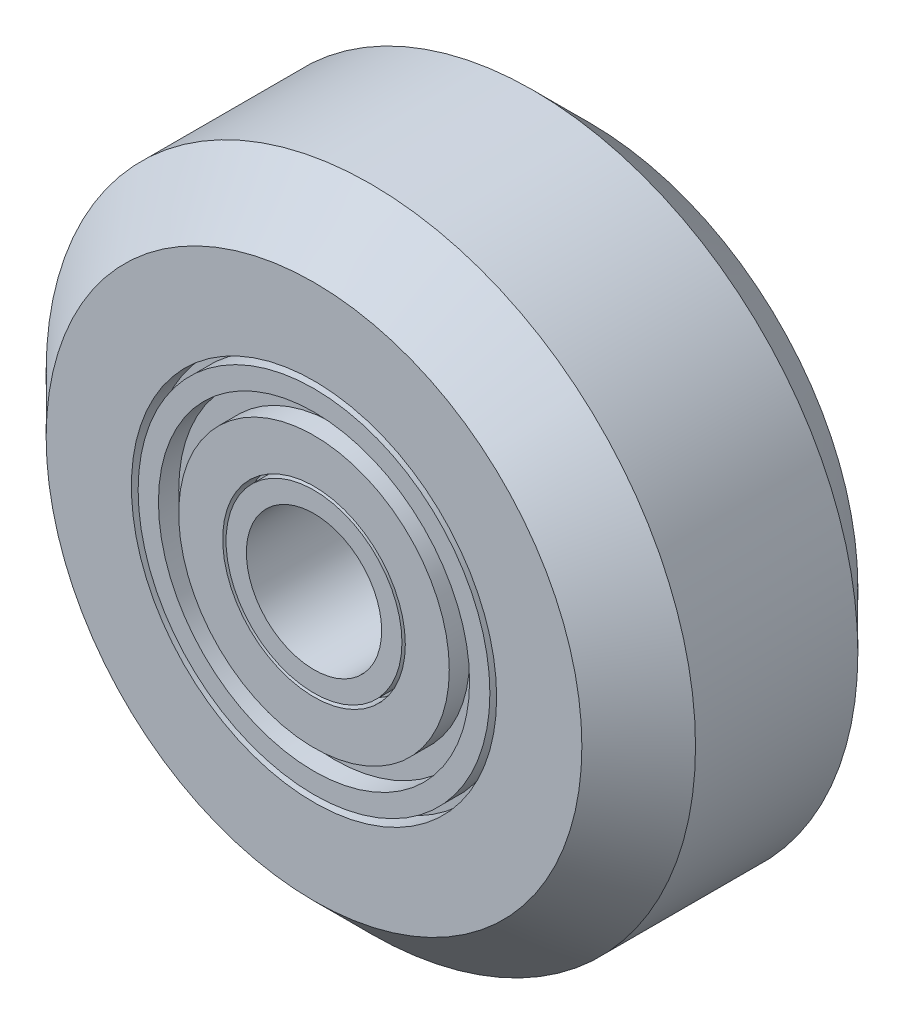
ISO-10303-21;
HEADER;
FILE_DESCRIPTION(('STEP AP214'),'2;1');
FILE_NAME('part.step','',(''),(''),'','','');
FILE_SCHEMA(('AUTOMOTIVE_DESIGN { 1 0 10303 214 1 1 1 1 }'));
ENDSEC;
DATA;
#1=APPLICATION_CONTEXT('core data for automotive mechanical design processes');
#2=APPLICATION_PROTOCOL_DEFINITION('international standard','automotive_design',2000,#1);
#3=PRODUCT_CONTEXT('',#1,'mechanical');
#4=PRODUCT('Part','Part','',(#3));
#5=PRODUCT_RELATED_PRODUCT_CATEGORY('part','',(#4));
#6=PRODUCT_DEFINITION_FORMATION('','',#4);
#7=PRODUCT_DEFINITION_CONTEXT('part definition',#1,'design');
#8=PRODUCT_DEFINITION('design','',#6,#7);
#9=PRODUCT_DEFINITION_SHAPE('','',#8);
#10=(LENGTH_UNIT() NAMED_UNIT(*) SI_UNIT(.MILLI.,.METRE.));
#11=(NAMED_UNIT(*) PLANE_ANGLE_UNIT() SI_UNIT($,.RADIAN.));
#12=(NAMED_UNIT(*) SI_UNIT($,.STERADIAN.) SOLID_ANGLE_UNIT());
#13=UNCERTAINTY_MEASURE_WITH_UNIT(LENGTH_MEASURE(1.E-05),#10,'distance_accuracy_value','');
#14=(GEOMETRIC_REPRESENTATION_CONTEXT(3) GLOBAL_UNCERTAINTY_ASSIGNED_CONTEXT((#13)) GLOBAL_UNIT_ASSIGNED_CONTEXT((#10,
#11,#12)) REPRESENTATION_CONTEXT('',''));
#15=CARTESIAN_POINT('',(0.,0.,0.));
#16=DIRECTION('',(0.,0.,1.));
#17=DIRECTION('',(1.,0.,0.));
#18=AXIS2_PLACEMENT_3D('',#15,#16,#17);
#19=CARTESIAN_POINT('',(0.,0.,-5.1));
#20=DIRECTION('',(0.,0.,-1.));
#21=DIRECTION('',(-1.,0.,0.));
#22=AXIS2_PLACEMENT_3D('',#19,#20,#21);
#23=PLANE('',#22);
#24=CARTESIAN_POINT('',(0.,0.,-5.1));
#25=DIRECTION('',(0.,0.,1.));
#26=DIRECTION('',(1.,0.,0.));
#27=AXIS2_PLACEMENT_3D('',#24,#25,#26);
#28=CIRCLE('',#27,2.5);
#29=CARTESIAN_POINT('',(2.5,0.,-5.1));
#30=VERTEX_POINT('',#29);
#31=EDGE_CURVE('E99',#30,#30,#28,.T.);
#32=ORIENTED_EDGE('',*,*,#31,.T.);
#33=EDGE_LOOP('',(#32));
#34=FACE_BOUND('',#33,.T.);
#35=CARTESIAN_POINT('',(0.,0.,-5.1));
#36=DIRECTION('',(0.,0.,1.));
#37=DIRECTION('',(1.,0.,0.));
#38=AXIS2_PLACEMENT_3D('',#35,#36,#37);
#39=CIRCLE('',#38,3.25);
#40=CARTESIAN_POINT('',(3.25,0.,-5.1));
#41=VERTEX_POINT('',#40);
#42=EDGE_CURVE('E161',#41,#41,#39,.T.);
#43=ORIENTED_EDGE('',*,*,#42,.F.);
#44=EDGE_LOOP('',(#43));
#45=FACE_BOUND('',#44,.T.);
#46=ADVANCED_FACE('F75',(#34,#45),#23,.T.);
#47=CARTESIAN_POINT('',(0.,0.,5.1));
#48=DIRECTION('',(0.,0.,1.));
#49=DIRECTION('',(1.,0.,0.));
#50=AXIS2_PLACEMENT_3D('',#47,#48,#49);
#51=PLANE('',#50);
#52=CARTESIAN_POINT('',(0.,0.,5.1));
#53=DIRECTION('',(0.,0.,1.));
#54=DIRECTION('',(1.,0.,0.));
#55=AXIS2_PLACEMENT_3D('',#52,#53,#54);
#56=CIRCLE('',#55,2.5);
#57=CARTESIAN_POINT('',(2.5,0.,5.1));
#58=VERTEX_POINT('',#57);
#59=EDGE_CURVE('E100',#58,#58,#56,.T.);
#60=ORIENTED_EDGE('',*,*,#59,.F.);
#61=EDGE_LOOP('',(#60));
#62=FACE_BOUND('',#61,.T.);
#63=CARTESIAN_POINT('',(0.,0.,5.1));
#64=DIRECTION('',(0.,0.,1.));
#65=DIRECTION('',(1.,0.,0.));
#66=AXIS2_PLACEMENT_3D('',#63,#64,#65);
#67=CIRCLE('',#66,3.25);
#68=CARTESIAN_POINT('',(3.25,0.,5.1));
#69=VERTEX_POINT('',#68);
#70=EDGE_CURVE('E113',#69,#69,#67,.T.);
#71=ORIENTED_EDGE('',*,*,#70,.T.);
#72=EDGE_LOOP('',(#71));
#73=FACE_BOUND('',#72,.T.);
#74=ADVANCED_FACE('F233',(#62,#73),#51,.T.);
#75=CARTESIAN_POINT('',(0.,0.,3.));
#76=DIRECTION('',(0.,0.,-1.));
#77=DIRECTION('',(-1.,0.,0.));
#78=AXIS2_PLACEMENT_3D('',#75,#76,#77);
#79=CYLINDRICAL_SURFACE('',#78,12.);
#80=CARTESIAN_POINT('',(0.,0.,3.));
#81=DIRECTION('',(0.,0.,1.));
#82=DIRECTION('',(1.,0.,0.));
#83=AXIS2_PLACEMENT_3D('',#80,#81,#82);
#84=CIRCLE('',#83,12.);
#85=CARTESIAN_POINT('',(12.,0.,3.));
#86=VERTEX_POINT('',#85);
#87=EDGE_CURVE('E11',#86,#86,#84,.T.);
#88=ORIENTED_EDGE('',*,*,#87,.F.);
#89=EDGE_LOOP('',(#88));
#90=FACE_BOUND('',#89,.T.);
#91=CARTESIAN_POINT('',(0.,0.,-3.));
#92=DIRECTION('',(0.,0.,-1.));
#93=DIRECTION('',(-1.,0.,0.));
#94=AXIS2_PLACEMENT_3D('',#91,#92,#93);
#95=CIRCLE('',#94,12.);
#96=CARTESIAN_POINT('',(-12.,0.,-3.));
#97=VERTEX_POINT('',#96);
#98=EDGE_CURVE('E93',#97,#97,#95,.T.);
#99=ORIENTED_EDGE('',*,*,#98,.F.);
#100=EDGE_LOOP('',(#99));
#101=FACE_BOUND('',#100,.T.);
#102=ADVANCED_FACE('F77',(#90,#101),#79,.T.);
#103=CARTESIAN_POINT('',(0.,0.,3.));
#104=DIRECTION('',(0.,0.,-1.));
#105=DIRECTION('',(1.,0.,0.));
#106=AXIS2_PLACEMENT_3D('',#103,#104,#105);
#107=CONICAL_SURFACE('',#106,12.,0.78539816339745);
#108=CARTESIAN_POINT('',(0.,0.,5.1));
#109=DIRECTION('',(0.,0.,1.));
#110=DIRECTION('',(1.,0.,0.));
#111=AXIS2_PLACEMENT_3D('',#108,#109,#110);
#112=CIRCLE('',#111,9.89999999999999);
#113=CARTESIAN_POINT('',(9.89999999999999,0.,5.1));
#114=VERTEX_POINT('',#113);
#115=EDGE_CURVE('E83',#114,#114,#112,.T.);
#116=ORIENTED_EDGE('',*,*,#115,.F.);
#117=EDGE_LOOP('',(#116));
#118=FACE_BOUND('',#117,.T.);
#119=ORIENTED_EDGE('',*,*,#87,.T.);
#120=EDGE_LOOP('',(#119));
#121=FACE_BOUND('',#120,.T.);
#122=ADVANCED_FACE('F263',(#118,#121),#107,.T.);
#123=CARTESIAN_POINT('',(0.,0.,5.1));
#124=DIRECTION('',(0.,0.,1.));
#125=DIRECTION('',(1.,0.,0.));
#126=AXIS2_PLACEMENT_3D('',#123,#124,#125);
#127=CIRCLE('',#126,6.75);
#128=CARTESIAN_POINT('',(6.75,0.,5.1));
#129=VERTEX_POINT('',#128);
#130=EDGE_CURVE('E140',#129,#129,#127,.T.);
#131=ORIENTED_EDGE('',*,*,#130,.F.);
#132=EDGE_LOOP('',(#131));
#133=FACE_BOUND('',#132,.T.);
#134=ORIENTED_EDGE('',*,*,#115,.T.);
#135=EDGE_LOOP('',(#134));
#136=FACE_BOUND('',#135,.T.);
#137=ADVANCED_FACE('F254',(#133,#136),#51,.T.);
#138=CARTESIAN_POINT('',(0.,0.,-3.));
#139=DIRECTION('',(0.,0.,1.));
#140=DIRECTION('',(-1.,0.,0.));
#141=AXIS2_PLACEMENT_3D('',#138,#139,#140);
#142=CONICAL_SURFACE('',#141,12.,0.78539816339745);
#143=CARTESIAN_POINT('',(0.,0.,-5.1));
#144=DIRECTION('',(0.,0.,-1.));
#145=DIRECTION('',(-1.,0.,0.));
#146=AXIS2_PLACEMENT_3D('',#143,#144,#145);
#147=CIRCLE('',#146,9.89999999999999);
#148=CARTESIAN_POINT('',(-9.89999999999999,0.,-5.1));
#149=VERTEX_POINT('',#148);
#150=EDGE_CURVE('E88',#149,#149,#147,.T.);
#151=ORIENTED_EDGE('',*,*,#150,.F.);
#152=EDGE_LOOP('',(#151));
#153=FACE_BOUND('',#152,.T.);
#154=ORIENTED_EDGE('',*,*,#98,.T.);
#155=EDGE_LOOP('',(#154));
#156=FACE_BOUND('',#155,.T.);
#157=ADVANCED_FACE('F246',(#153,#156),#142,.T.);
#158=CARTESIAN_POINT('',(0.,0.,-5.1));
#159=DIRECTION('',(0.,0.,1.));
#160=DIRECTION('',(1.,0.,0.));
#161=AXIS2_PLACEMENT_3D('',#158,#159,#160);
#162=CIRCLE('',#161,6.75);
#163=CARTESIAN_POINT('',(6.75,0.,-5.1));
#164=VERTEX_POINT('',#163);
#165=EDGE_CURVE('E188',#164,#164,#162,.T.);
#166=ORIENTED_EDGE('',*,*,#165,.T.);
#167=EDGE_LOOP('',(#166));
#168=FACE_BOUND('',#167,.T.);
#169=ORIENTED_EDGE('',*,*,#150,.T.);
#170=EDGE_LOOP('',(#169));
#171=FACE_BOUND('',#170,.T.);
#172=ADVANCED_FACE('F229',(#168,#171),#23,.T.);
#173=CARTESIAN_POINT('',(0.,0.,-5.1));
#174=DIRECTION('',(0.,0.,1.));
#175=DIRECTION('',(1.,0.,0.));
#176=AXIS2_PLACEMENT_3D('',#173,#174,#175);
#177=CYLINDRICAL_SURFACE('',#176,2.5);
#178=ORIENTED_EDGE('',*,*,#31,.F.);
#179=EDGE_LOOP('',(#178));
#180=FACE_BOUND('',#179,.T.);
#181=ORIENTED_EDGE('',*,*,#59,.T.);
#182=EDGE_LOOP('',(#181));
#183=FACE_BOUND('',#182,.T.);
#184=ADVANCED_FACE('F245',(#180,#183),#177,.F.);
#185=CARTESIAN_POINT('',(0.,0.,4.35));
#186=DIRECTION('',(0.,0.,1.));
#187=DIRECTION('',(1.,0.,0.));
#188=AXIS2_PLACEMENT_3D('',#185,#186,#187);
#189=CYLINDRICAL_SURFACE('',#188,3.25);
#190=CARTESIAN_POINT('',(0.,0.,4.35));
#191=DIRECTION('',(0.,0.,1.));
#192=DIRECTION('',(1.,0.,0.));
#193=AXIS2_PLACEMENT_3D('',#190,#191,#192);
#194=CIRCLE('',#193,3.25);
#195=CARTESIAN_POINT('',(3.25,0.,4.35));
#196=VERTEX_POINT('',#195);
#197=EDGE_CURVE('E112',#196,#196,#194,.T.);
#198=ORIENTED_EDGE('',*,*,#197,.T.);
#199=EDGE_LOOP('',(#198));
#200=FACE_BOUND('',#199,.T.);
#201=ORIENTED_EDGE('',*,*,#70,.F.);
#202=EDGE_LOOP('',(#201));
#203=FACE_BOUND('',#202,.T.);
#204=ADVANCED_FACE('F252',(#200,#203),#189,.T.);
#205=CARTESIAN_POINT('',(0.,0.,4.35));
#206=DIRECTION('',(0.,0.,1.));
#207=DIRECTION('',(1.,0.,0.));
#208=AXIS2_PLACEMENT_3D('',#205,#206,#207);
#209=CYLINDRICAL_SURFACE('',#208,3.375);
#210=CARTESIAN_POINT('',(0.,0.,4.35));
#211=DIRECTION('',(0.,0.,1.));
#212=DIRECTION('',(1.,0.,0.));
#213=AXIS2_PLACEMENT_3D('',#210,#211,#212);
#214=CIRCLE('',#213,3.375);
#215=CARTESIAN_POINT('',(3.375,0.,4.35));
#216=VERTEX_POINT('',#215);
#217=EDGE_CURVE('E104',#216,#216,#214,.T.);
#218=ORIENTED_EDGE('',*,*,#217,.F.);
#219=EDGE_LOOP('',(#218));
#220=FACE_BOUND('',#219,.T.);
#221=CARTESIAN_POINT('',(0.,0.,5.1));
#222=DIRECTION('',(0.,0.,1.));
#223=DIRECTION('',(1.,0.,0.));
#224=AXIS2_PLACEMENT_3D('',#221,#222,#223);
#225=CIRCLE('',#224,3.375);
#226=CARTESIAN_POINT('',(3.375,0.,5.1));
#227=VERTEX_POINT('',#226);
#228=EDGE_CURVE('E108',#227,#227,#225,.T.);
#229=ORIENTED_EDGE('',*,*,#228,.T.);
#230=EDGE_LOOP('',(#229));
#231=FACE_BOUND('',#230,.T.);
#232=ADVANCED_FACE('F314',(#220,#231),#209,.F.);
#233=CARTESIAN_POINT('',(0.,0.,4.35));
#234=DIRECTION('',(0.,0.,1.));
#235=DIRECTION('',(1.,0.,0.));
#236=AXIS2_PLACEMENT_3D('',#233,#234,#235);
#237=PLANE('',#236);
#238=ORIENTED_EDGE('',*,*,#197,.F.);
#239=EDGE_LOOP('',(#238));
#240=FACE_BOUND('',#239,.T.);
#241=ORIENTED_EDGE('',*,*,#217,.T.);
#242=EDGE_LOOP('',(#241));
#243=FACE_BOUND('',#242,.T.);
#244=ADVANCED_FACE('F316',(#240,#243),#237,.T.);
#245=CARTESIAN_POINT('',(0.,0.,4.35));
#246=DIRECTION('',(0.,0.,1.));
#247=DIRECTION('',(1.,0.,0.));
#248=AXIS2_PLACEMENT_3D('',#245,#246,#247);
#249=CYLINDRICAL_SURFACE('',#248,6.5);
#250=CARTESIAN_POINT('',(0.,0.,4.35));
#251=DIRECTION('',(0.,0.,1.));
#252=DIRECTION('',(1.,0.,0.));
#253=AXIS2_PLACEMENT_3D('',#250,#251,#252);
#254=CIRCLE('',#253,6.5);
#255=CARTESIAN_POINT('',(6.5,0.,4.35));
#256=VERTEX_POINT('',#255);
#257=EDGE_CURVE('E144',#256,#256,#254,.T.);
#258=ORIENTED_EDGE('',*,*,#257,.T.);
#259=EDGE_LOOP('',(#258));
#260=FACE_BOUND('',#259,.T.);
#261=CARTESIAN_POINT('',(0.,0.,5.1));
#262=DIRECTION('',(0.,0.,1.));
#263=DIRECTION('',(1.,0.,0.));
#264=AXIS2_PLACEMENT_3D('',#261,#262,#263);
#265=CIRCLE('',#264,6.5);
#266=CARTESIAN_POINT('',(6.5,0.,5.1));
#267=VERTEX_POINT('',#266);
#268=EDGE_CURVE('E145',#267,#267,#265,.T.);
#269=ORIENTED_EDGE('',*,*,#268,.F.);
#270=EDGE_LOOP('',(#269));
#271=FACE_BOUND('',#270,.T.);
#272=ADVANCED_FACE('F323',(#260,#271),#249,.T.);
#273=CARTESIAN_POINT('',(0.,0.,4.35));
#274=DIRECTION('',(0.,0.,1.));
#275=DIRECTION('',(1.,0.,0.));
#276=AXIS2_PLACEMENT_3D('',#273,#274,#275);
#277=CYLINDRICAL_SURFACE('',#276,6.75);
#278=CARTESIAN_POINT('',(0.,0.,4.35));
#279=DIRECTION('',(0.,0.,1.));
#280=DIRECTION('',(1.,0.,0.));
#281=AXIS2_PLACEMENT_3D('',#278,#279,#280);
#282=CIRCLE('',#281,6.75);
#283=CARTESIAN_POINT('',(6.75,0.,4.35));
#284=VERTEX_POINT('',#283);
#285=EDGE_CURVE('E133',#284,#284,#282,.T.);
#286=ORIENTED_EDGE('',*,*,#285,.F.);
#287=EDGE_LOOP('',(#286));
#288=FACE_BOUND('',#287,.T.);
#289=ORIENTED_EDGE('',*,*,#130,.T.);
#290=EDGE_LOOP('',(#289));
#291=FACE_BOUND('',#290,.T.);
#292=ADVANCED_FACE('F291',(#288,#291),#277,.F.);
#293=CARTESIAN_POINT('',(0.,0.,4.35));
#294=DIRECTION('',(0.,0.,1.));
#295=DIRECTION('',(1.,0.,0.));
#296=AXIS2_PLACEMENT_3D('',#293,#294,#295);
#297=PLANE('',#296);
#298=ORIENTED_EDGE('',*,*,#257,.F.);
#299=EDGE_LOOP('',(#298));
#300=FACE_BOUND('',#299,.T.);
#301=ORIENTED_EDGE('',*,*,#285,.T.);
#302=EDGE_LOOP('',(#301));
#303=FACE_BOUND('',#302,.T.);
#304=ADVANCED_FACE('F282',(#300,#303),#297,.T.);
#305=CARTESIAN_POINT('',(0.,0.,5.1));
#306=DIRECTION('',(0.,0.,1.));
#307=DIRECTION('',(1.,0.,0.));
#308=AXIS2_PLACEMENT_3D('',#305,#306,#307);
#309=CIRCLE('',#308,5.75);
#310=CARTESIAN_POINT('',(5.75,0.,5.1));
#311=VERTEX_POINT('',#310);
#312=EDGE_CURVE('E124',#311,#311,#309,.T.);
#313=ORIENTED_EDGE('',*,*,#312,.F.);
#314=EDGE_LOOP('',(#313));
#315=FACE_BOUND('',#314,.T.);
#316=ORIENTED_EDGE('',*,*,#268,.T.);
#317=EDGE_LOOP('',(#316));
#318=FACE_BOUND('',#317,.T.);
#319=ADVANCED_FACE('F272',(#315,#318),#51,.T.);
#320=CARTESIAN_POINT('',(0.,0.,4.35));
#321=DIRECTION('',(0.,0.,1.));
#322=DIRECTION('',(1.,0.,0.));
#323=AXIS2_PLACEMENT_3D('',#320,#321,#322);
#324=CYLINDRICAL_SURFACE('',#323,5.);
#325=CARTESIAN_POINT('',(0.,0.,4.35));
#326=DIRECTION('',(0.,0.,1.));
#327=DIRECTION('',(1.,0.,0.));
#328=AXIS2_PLACEMENT_3D('',#325,#326,#327);
#329=CIRCLE('',#328,5.);
#330=CARTESIAN_POINT('',(5.,0.,4.35));
#331=VERTEX_POINT('',#330);
#332=EDGE_CURVE('E128',#331,#331,#329,.T.);
#333=ORIENTED_EDGE('',*,*,#332,.T.);
#334=EDGE_LOOP('',(#333));
#335=FACE_BOUND('',#334,.T.);
#336=CARTESIAN_POINT('',(0.,0.,5.1));
#337=DIRECTION('',(0.,0.,1.));
#338=DIRECTION('',(1.,0.,0.));
#339=AXIS2_PLACEMENT_3D('',#336,#337,#338);
#340=CIRCLE('',#339,5.);
#341=CARTESIAN_POINT('',(5.,0.,5.1));
#342=VERTEX_POINT('',#341);
#343=EDGE_CURVE('E129',#342,#342,#340,.T.);
#344=ORIENTED_EDGE('',*,*,#343,.F.);
#345=EDGE_LOOP('',(#344));
#346=FACE_BOUND('',#345,.T.);
#347=ADVANCED_FACE('F281',(#335,#346),#324,.T.);
#348=CARTESIAN_POINT('',(0.,0.,4.35));
#349=DIRECTION('',(0.,0.,1.));
#350=DIRECTION('',(1.,0.,0.));
#351=AXIS2_PLACEMENT_3D('',#348,#349,#350);
#352=CYLINDRICAL_SURFACE('',#351,5.75);
#353=CARTESIAN_POINT('',(0.,0.,4.35));
#354=DIRECTION('',(0.,0.,1.));
#355=DIRECTION('',(1.,0.,0.));
#356=AXIS2_PLACEMENT_3D('',#353,#354,#355);
#357=CIRCLE('',#356,5.75);
#358=CARTESIAN_POINT('',(5.75,0.,4.35));
#359=VERTEX_POINT('',#358);
#360=EDGE_CURVE('E117',#359,#359,#357,.T.);
#361=ORIENTED_EDGE('',*,*,#360,.F.);
#362=EDGE_LOOP('',(#361));
#363=FACE_BOUND('',#362,.T.);
#364=ORIENTED_EDGE('',*,*,#312,.T.);
#365=EDGE_LOOP('',(#364));
#366=FACE_BOUND('',#365,.T.);
#367=ADVANCED_FACE('F288',(#363,#366),#352,.F.);
#368=CARTESIAN_POINT('',(0.,0.,4.35));
#369=DIRECTION('',(0.,0.,1.));
#370=DIRECTION('',(1.,0.,0.));
#371=AXIS2_PLACEMENT_3D('',#368,#369,#370);
#372=PLANE('',#371);
#373=ORIENTED_EDGE('',*,*,#332,.F.);
#374=EDGE_LOOP('',(#373));
#375=FACE_BOUND('',#374,.T.);
#376=ORIENTED_EDGE('',*,*,#360,.T.);
#377=EDGE_LOOP('',(#376));
#378=FACE_BOUND('',#377,.T.);
#379=ADVANCED_FACE('F298',(#375,#378),#372,.T.);
#380=ORIENTED_EDGE('',*,*,#228,.F.);
#381=EDGE_LOOP('',(#380));
#382=FACE_BOUND('',#381,.T.);
#383=ORIENTED_EDGE('',*,*,#343,.T.);
#384=EDGE_LOOP('',(#383));
#385=FACE_BOUND('',#384,.T.);
#386=ADVANCED_FACE('F279',(#382,#385),#51,.T.);
#387=CARTESIAN_POINT('',(0.,0.,-4.35));
#388=DIRECTION('',(0.,0.,-1.));
#389=DIRECTION('',(-1.,0.,0.));
#390=AXIS2_PLACEMENT_3D('',#387,#388,#389);
#391=CYLINDRICAL_SURFACE('',#390,3.25);
#392=CARTESIAN_POINT('',(0.,0.,-4.35));
#393=DIRECTION('',(0.,0.,1.));
#394=DIRECTION('',(1.,0.,0.));
#395=AXIS2_PLACEMENT_3D('',#392,#393,#394);
#396=CIRCLE('',#395,3.25);
#397=CARTESIAN_POINT('',(3.25,0.,-4.35));
#398=VERTEX_POINT('',#397);
#399=EDGE_CURVE('E160',#398,#398,#396,.T.);
#400=ORIENTED_EDGE('',*,*,#399,.F.);
#401=EDGE_LOOP('',(#400));
#402=FACE_BOUND('',#401,.T.);
#403=ORIENTED_EDGE('',*,*,#42,.T.);
#404=EDGE_LOOP('',(#403));
#405=FACE_BOUND('',#404,.T.);
#406=ADVANCED_FACE('F297',(#402,#405),#391,.T.);
#407=CARTESIAN_POINT('',(0.,0.,-4.35));
#408=DIRECTION('',(0.,0.,-1.));
#409=DIRECTION('',(-1.,0.,0.));
#410=AXIS2_PLACEMENT_3D('',#407,#408,#409);
#411=CYLINDRICAL_SURFACE('',#410,3.375);
#412=CARTESIAN_POINT('',(0.,0.,-4.35));
#413=DIRECTION('',(0.,0.,1.));
#414=DIRECTION('',(1.,0.,0.));
#415=AXIS2_PLACEMENT_3D('',#412,#413,#414);
#416=CIRCLE('',#415,3.375);
#417=CARTESIAN_POINT('',(3.375,0.,-4.35));
#418=VERTEX_POINT('',#417);
#419=EDGE_CURVE('E149',#418,#418,#416,.T.);
#420=ORIENTED_EDGE('',*,*,#419,.T.);
#421=EDGE_LOOP('',(#420));
#422=FACE_BOUND('',#421,.T.);
#423=CARTESIAN_POINT('',(0.,0.,-5.1));
#424=DIRECTION('',(0.,0.,1.));
#425=DIRECTION('',(1.,0.,0.));
#426=AXIS2_PLACEMENT_3D('',#423,#424,#425);
#427=CIRCLE('',#426,3.375);
#428=CARTESIAN_POINT('',(3.375,0.,-5.1));
#429=VERTEX_POINT('',#428);
#430=EDGE_CURVE('E156',#429,#429,#427,.T.);
#431=ORIENTED_EDGE('',*,*,#430,.F.);
#432=EDGE_LOOP('',(#431));
#433=FACE_BOUND('',#432,.T.);
#434=ADVANCED_FACE('F304',(#422,#433),#411,.F.);
#435=CARTESIAN_POINT('',(0.,0.,-4.35));
#436=DIRECTION('',(0.,0.,-1.));
#437=DIRECTION('',(1.,0.,0.));
#438=AXIS2_PLACEMENT_3D('',#435,#436,#437);
#439=PLANE('',#438);
#440=ORIENTED_EDGE('',*,*,#399,.T.);
#441=EDGE_LOOP('',(#440));
#442=FACE_BOUND('',#441,.T.);
#443=ORIENTED_EDGE('',*,*,#419,.F.);
#444=EDGE_LOOP('',(#443));
#445=FACE_BOUND('',#444,.T.);
#446=ADVANCED_FACE('F211',(#442,#445),#439,.T.);
#447=CARTESIAN_POINT('',(0.,0.,-4.35));
#448=DIRECTION('',(0.,0.,-1.));
#449=DIRECTION('',(-1.,0.,0.));
#450=AXIS2_PLACEMENT_3D('',#447,#448,#449);
#451=CYLINDRICAL_SURFACE('',#450,6.5);
#452=CARTESIAN_POINT('',(0.,0.,-4.35));
#453=DIRECTION('',(0.,0.,1.));
#454=DIRECTION('',(1.,0.,0.));
#455=AXIS2_PLACEMENT_3D('',#452,#453,#454);
#456=CIRCLE('',#455,6.5);
#457=CARTESIAN_POINT('',(6.5,0.,-4.35));
#458=VERTEX_POINT('',#457);
#459=EDGE_CURVE('E192',#458,#458,#456,.T.);
#460=ORIENTED_EDGE('',*,*,#459,.F.);
#461=EDGE_LOOP('',(#460));
#462=FACE_BOUND('',#461,.T.);
#463=CARTESIAN_POINT('',(0.,0.,-5.1));
#464=DIRECTION('',(0.,0.,1.));
#465=DIRECTION('',(1.,0.,0.));
#466=AXIS2_PLACEMENT_3D('',#463,#464,#465);
#467=CIRCLE('',#466,6.5);
#468=CARTESIAN_POINT('',(6.5,0.,-5.1));
#469=VERTEX_POINT('',#468);
#470=EDGE_CURVE('E193',#469,#469,#467,.T.);
#471=ORIENTED_EDGE('',*,*,#470,.T.);
#472=EDGE_LOOP('',(#471));
#473=FACE_BOUND('',#472,.T.);
#474=ADVANCED_FACE('F207',(#462,#473),#451,.T.);
#475=CARTESIAN_POINT('',(0.,0.,-4.35));
#476=DIRECTION('',(0.,0.,-1.));
#477=DIRECTION('',(-1.,0.,0.));
#478=AXIS2_PLACEMENT_3D('',#475,#476,#477);
#479=CYLINDRICAL_SURFACE('',#478,6.75);
#480=CARTESIAN_POINT('',(0.,0.,-4.35));
#481=DIRECTION('',(0.,0.,1.));
#482=DIRECTION('',(1.,0.,0.));
#483=AXIS2_PLACEMENT_3D('',#480,#481,#482);
#484=CIRCLE('',#483,6.75);
#485=CARTESIAN_POINT('',(6.75,0.,-4.35));
#486=VERTEX_POINT('',#485);
#487=EDGE_CURVE('E181',#486,#486,#484,.T.);
#488=ORIENTED_EDGE('',*,*,#487,.T.);
#489=EDGE_LOOP('',(#488));
#490=FACE_BOUND('',#489,.T.);
#491=ORIENTED_EDGE('',*,*,#165,.F.);
#492=EDGE_LOOP('',(#491));
#493=FACE_BOUND('',#492,.T.);
#494=ADVANCED_FACE('F210',(#490,#493),#479,.F.);
#495=CARTESIAN_POINT('',(0.,0.,-4.35));
#496=DIRECTION('',(0.,0.,-1.));
#497=DIRECTION('',(1.,0.,0.));
#498=AXIS2_PLACEMENT_3D('',#495,#496,#497);
#499=PLANE('',#498);
#500=ORIENTED_EDGE('',*,*,#459,.T.);
#501=EDGE_LOOP('',(#500));
#502=FACE_BOUND('',#501,.T.);
#503=ORIENTED_EDGE('',*,*,#487,.F.);
#504=EDGE_LOOP('',(#503));
#505=FACE_BOUND('',#504,.T.);
#506=ADVANCED_FACE('F204',(#502,#505),#499,.T.);
#507=CARTESIAN_POINT('',(0.,0.,-5.1));
#508=DIRECTION('',(0.,0.,1.));
#509=DIRECTION('',(1.,0.,0.));
#510=AXIS2_PLACEMENT_3D('',#507,#508,#509);
#511=CIRCLE('',#510,5.75);
#512=CARTESIAN_POINT('',(5.75,0.,-5.1));
#513=VERTEX_POINT('',#512);
#514=EDGE_CURVE('E172',#513,#513,#511,.T.);
#515=ORIENTED_EDGE('',*,*,#514,.T.);
#516=EDGE_LOOP('',(#515));
#517=FACE_BOUND('',#516,.T.);
#518=ORIENTED_EDGE('',*,*,#470,.F.);
#519=EDGE_LOOP('',(#518));
#520=FACE_BOUND('',#519,.T.);
#521=ADVANCED_FACE('F215',(#517,#520),#23,.T.);
#522=CARTESIAN_POINT('',(0.,0.,-4.35));
#523=DIRECTION('',(0.,0.,-1.));
#524=DIRECTION('',(-1.,0.,0.));
#525=AXIS2_PLACEMENT_3D('',#522,#523,#524);
#526=CYLINDRICAL_SURFACE('',#525,5.);
#527=CARTESIAN_POINT('',(0.,0.,-4.35));
#528=DIRECTION('',(0.,0.,1.));
#529=DIRECTION('',(1.,0.,0.));
#530=AXIS2_PLACEMENT_3D('',#527,#528,#529);
#531=CIRCLE('',#530,5.);
#532=CARTESIAN_POINT('',(5.,0.,-4.35));
#533=VERTEX_POINT('',#532);
#534=EDGE_CURVE('E176',#533,#533,#531,.T.);
#535=ORIENTED_EDGE('',*,*,#534,.F.);
#536=EDGE_LOOP('',(#535));
#537=FACE_BOUND('',#536,.T.);
#538=CARTESIAN_POINT('',(0.,0.,-5.1));
#539=DIRECTION('',(0.,0.,1.));
#540=DIRECTION('',(1.,0.,0.));
#541=AXIS2_PLACEMENT_3D('',#538,#539,#540);
#542=CIRCLE('',#541,5.);
#543=CARTESIAN_POINT('',(5.,0.,-5.1));
#544=VERTEX_POINT('',#543);
#545=EDGE_CURVE('E177',#544,#544,#542,.T.);
#546=ORIENTED_EDGE('',*,*,#545,.T.);
#547=EDGE_LOOP('',(#546));
#548=FACE_BOUND('',#547,.T.);
#549=ADVANCED_FACE('F217',(#537,#548),#526,.T.);
#550=CARTESIAN_POINT('',(0.,0.,-4.35));
#551=DIRECTION('',(0.,0.,-1.));
#552=DIRECTION('',(-1.,0.,0.));
#553=AXIS2_PLACEMENT_3D('',#550,#551,#552);
#554=CYLINDRICAL_SURFACE('',#553,5.75);
#555=CARTESIAN_POINT('',(0.,0.,-4.35));
#556=DIRECTION('',(0.,0.,1.));
#557=DIRECTION('',(1.,0.,0.));
#558=AXIS2_PLACEMENT_3D('',#555,#556,#557);
#559=CIRCLE('',#558,5.75);
#560=CARTESIAN_POINT('',(5.75,0.,-4.35));
#561=VERTEX_POINT('',#560);
#562=EDGE_CURVE('E165',#561,#561,#559,.T.);
#563=ORIENTED_EDGE('',*,*,#562,.T.);
#564=EDGE_LOOP('',(#563));
#565=FACE_BOUND('',#564,.T.);
#566=ORIENTED_EDGE('',*,*,#514,.F.);
#567=EDGE_LOOP('',(#566));
#568=FACE_BOUND('',#567,.T.);
#569=ADVANCED_FACE('F225',(#565,#568),#554,.F.);
#570=CARTESIAN_POINT('',(0.,0.,-4.35));
#571=DIRECTION('',(0.,0.,-1.));
#572=DIRECTION('',(1.,0.,0.));
#573=AXIS2_PLACEMENT_3D('',#570,#571,#572);
#574=PLANE('',#573);
#575=ORIENTED_EDGE('',*,*,#534,.T.);
#576=EDGE_LOOP('',(#575));
#577=FACE_BOUND('',#576,.T.);
#578=ORIENTED_EDGE('',*,*,#562,.F.);
#579=EDGE_LOOP('',(#578));
#580=FACE_BOUND('',#579,.T.);
#581=ADVANCED_FACE('F236',(#577,#580),#574,.T.);
#582=ORIENTED_EDGE('',*,*,#430,.T.);
#583=EDGE_LOOP('',(#582));
#584=FACE_BOUND('',#583,.T.);
#585=ORIENTED_EDGE('',*,*,#545,.F.);
#586=EDGE_LOOP('',(#585));
#587=FACE_BOUND('',#586,.T.);
#588=ADVANCED_FACE('F220',(#584,#587),#23,.T.);
#589=CLOSED_SHELL('',(#46,#74,#102,#122,#137,#157,#172,#184,#204,#232,#244,#272,#292,#304,#319,
#347,#367,#379,#386,#406,#434,#446,#474,#494,#506,#521,#549,#569,#581,#588));
#590=MANIFOLD_SOLID_BREP('B2',#589);
#591=ADVANCED_BREP_SHAPE_REPRESENTATION('',(#18,#590),#14);
#592=SHAPE_DEFINITION_REPRESENTATION(#9,#591);
ENDSEC;
END-ISO-10303-21;
